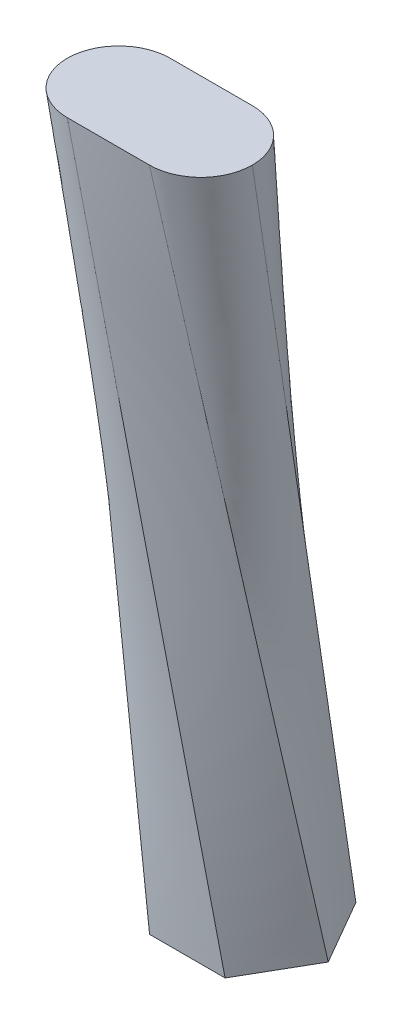
ISO-10303-21;
HEADER;
FILE_DESCRIPTION(('STEP AP214'),'2;1');
FILE_NAME('part.step','',(''),(''),'','','');
FILE_SCHEMA(('AUTOMOTIVE_DESIGN { 1 0 10303 214 1 1 1 1 }'));
ENDSEC;
DATA;
#1=APPLICATION_CONTEXT('core data for automotive mechanical design processes');
#2=APPLICATION_PROTOCOL_DEFINITION('international standard','automotive_design',2000,#1);
#3=PRODUCT_CONTEXT('',#1,'mechanical');
#4=PRODUCT('Part','Part','',(#3));
#5=PRODUCT_RELATED_PRODUCT_CATEGORY('part','',(#4));
#6=PRODUCT_DEFINITION_FORMATION('','',#4);
#7=PRODUCT_DEFINITION_CONTEXT('part definition',#1,'design');
#8=PRODUCT_DEFINITION('design','',#6,#7);
#9=PRODUCT_DEFINITION_SHAPE('','',#8);
#10=(LENGTH_UNIT() NAMED_UNIT(*) SI_UNIT(.MILLI.,.METRE.));
#11=(NAMED_UNIT(*) PLANE_ANGLE_UNIT() SI_UNIT($,.RADIAN.));
#12=(NAMED_UNIT(*) SI_UNIT($,.STERADIAN.) SOLID_ANGLE_UNIT());
#13=UNCERTAINTY_MEASURE_WITH_UNIT(LENGTH_MEASURE(1.E-05),#10,'distance_accuracy_value','');
#14=(GEOMETRIC_REPRESENTATION_CONTEXT(3) GLOBAL_UNCERTAINTY_ASSIGNED_CONTEXT((#13)) GLOBAL_UNIT_ASSIGNED_CONTEXT((#10,
#11,#12)) REPRESENTATION_CONTEXT('',''));
#15=CARTESIAN_POINT('',(0.,0.,0.));
#16=DIRECTION('',(0.,0.,1.));
#17=DIRECTION('',(1.,0.,0.));
#18=AXIS2_PLACEMENT_3D('',#15,#16,#17);
#19=CARTESIAN_POINT('',(0.,-698.8189008,0.));
#20=DIRECTION('',(0.,1.,0.));
#21=DIRECTION('',(0.,0.,1.));
#22=AXIS2_PLACEMENT_3D('',#19,#20,#21);
#23=PLANE('',#22);
#24=DIRECTION('',(1.,0.,0.));
#25=VECTOR('',#24,1.);
#26=CARTESIAN_POINT('',(-35.4084634377862,-698.8189008,84.0918648163071));
#27=LINE('',#26,#25);
#28=CARTESIAN_POINT('',(-35.4084634377862,-698.8189008,84.0918648163071));
#29=VERTEX_POINT('',#28);
#30=CARTESIAN_POINT('',(35.4084634377862,-698.8189008,84.0918648163071));
#31=VERTEX_POINT('',#30);
#32=EDGE_CURVE('E124',#29,#31,#27,.T.);
#33=ORIENTED_EDGE('',*,*,#32,.F.);
#34=DIRECTION('',(0.5,0.,0.866025403784439));
#35=VECTOR('',#34,1.);
#36=CARTESIAN_POINT('',(-70.8169268755724,-698.8189008,22.7626071241164));
#37=LINE('',#36,#35);
#38=CARTESIAN_POINT('',(-70.8169268755724,-698.8189008,22.7626071241164));
#39=VERTEX_POINT('',#38);
#40=EDGE_CURVE('E114',#39,#29,#37,.T.);
#41=ORIENTED_EDGE('',*,*,#40,.F.);
#42=DIRECTION('',(-0.5,0.,0.866025403784439));
#43=VECTOR('',#42,1.);
#44=CARTESIAN_POINT('',(-35.4084634377863,-698.8189008,-38.5666505680744));
#45=LINE('',#44,#43);
#46=CARTESIAN_POINT('',(-35.4084634377863,-698.8189008,-38.5666505680744));
#47=VERTEX_POINT('',#46);
#48=EDGE_CURVE('E138',#47,#39,#45,.T.);
#49=ORIENTED_EDGE('',*,*,#48,.F.);
#50=DIRECTION('',(-1.,0.,0.));
#51=VECTOR('',#50,1.);
#52=CARTESIAN_POINT('',(35.4084634377862,-698.8189008,-38.5666505680744));
#53=LINE('',#52,#51);
#54=CARTESIAN_POINT('',(35.4084634377862,-698.8189008,-38.5666505680744));
#55=VERTEX_POINT('',#54);
#56=EDGE_CURVE('E160',#55,#47,#53,.T.);
#57=ORIENTED_EDGE('',*,*,#56,.F.);
#58=DIRECTION('',(-0.5,0.,-0.866025403784438));
#59=VECTOR('',#58,1.);
#60=CARTESIAN_POINT('',(70.8169268755724,-698.8189008,22.7626071241163));
#61=LINE('',#60,#59);
#62=CARTESIAN_POINT('',(70.8169268755724,-698.8189008,22.7626071241163));
#63=VERTEX_POINT('',#62);
#64=EDGE_CURVE('E149',#63,#55,#61,.T.);
#65=ORIENTED_EDGE('',*,*,#64,.F.);
#66=DIRECTION('',(0.5,0.,-0.866025403784439));
#67=VECTOR('',#66,1.);
#68=CARTESIAN_POINT('',(35.4084634377862,-698.8189008,84.0918648163071));
#69=LINE('',#68,#67);
#70=EDGE_CURVE('E143',#31,#63,#69,.T.);
#71=ORIENTED_EDGE('',*,*,#70,.F.);
#72=EDGE_LOOP('',(#33,#41,#49,#57,#65,#71));
#73=FACE_BOUND('',#72,.T.);
#74=ADVANCED_FACE('F67',(#73),#23,.F.);
#75=CARTESIAN_POINT('',(-38.5065648534128,0.,109.89447289182));
#76=DIRECTION('',(0.,1.,0.));
#77=DIRECTION('',(0.,0.,1.));
#78=AXIS2_PLACEMENT_3D('',#75,#76,#77);
#79=PLANE('',#78);
#80=CARTESIAN_POINT('',(-38.5065648534128,0.,109.89447289182));
#81=DIRECTION('',(0.,1.,0.));
#82=DIRECTION('',(0.,0.,1.));
#83=AXIS2_PLACEMENT_3D('',#80,#81,#82);
#84=CIRCLE('',#83,48.2563794323738);
#85=CARTESIAN_POINT('',(-38.5065648534128,0.,61.6380934594463));
#86=VERTEX_POINT('',#85);
#87=CARTESIAN_POINT('',(-86.7629442857865,0.,109.89447289182));
#88=VERTEX_POINT('',#87);
#89=EDGE_CURVE('E86',#86,#88,#84,.T.);
#90=ORIENTED_EDGE('',*,*,#89,.T.);
#91=CARTESIAN_POINT('',(-38.5065648534128,0.,158.150852324194));
#92=VERTEX_POINT('',#91);
#93=EDGE_CURVE('E127',#88,#92,#84,.T.);
#94=ORIENTED_EDGE('',*,*,#93,.T.);
#95=DIRECTION('',(1.,0.,0.));
#96=VECTOR('',#95,1.);
#97=CARTESIAN_POINT('',(-38.5065648534128,0.,158.150852324194));
#98=LINE('',#97,#96);
#99=CARTESIAN_POINT('',(38.5065648534128,0.,158.150852324194));
#100=VERTEX_POINT('',#99);
#101=EDGE_CURVE('E236',#92,#100,#98,.T.);
#102=ORIENTED_EDGE('',*,*,#101,.T.);
#103=CARTESIAN_POINT('',(38.5065648534128,0.,109.89447289182));
#104=DIRECTION('',(0.,1.,0.));
#105=DIRECTION('',(0.,0.,1.));
#106=AXIS2_PLACEMENT_3D('',#103,#104,#105);
#107=CIRCLE('',#106,48.2563794323738);
#108=CARTESIAN_POINT('',(86.7629442857865,0.,109.89447289182));
#109=VERTEX_POINT('',#108);
#110=EDGE_CURVE('E78',#100,#109,#107,.T.);
#111=ORIENTED_EDGE('',*,*,#110,.T.);
#112=CARTESIAN_POINT('',(38.5065648534128,0.,61.6380934594463));
#113=VERTEX_POINT('',#112);
#114=EDGE_CURVE('E246',#109,#113,#107,.T.);
#115=ORIENTED_EDGE('',*,*,#114,.T.);
#116=DIRECTION('',(-1.,0.,0.));
#117=VECTOR('',#116,1.);
#118=CARTESIAN_POINT('',(-38.5065648534128,0.,61.6380934594463));
#119=LINE('',#118,#117);
#120=EDGE_CURVE('E12',#113,#86,#119,.T.);
#121=ORIENTED_EDGE('',*,*,#120,.T.);
#122=EDGE_LOOP('',(#90,#94,#102,#111,#115,#121));
#123=FACE_BOUND('',#122,.T.);
#124=ADVANCED_FACE('F190',(#123),#79,.T.);
#125=CARTESIAN_POINT('',(-38.5065648534128,0.,158.150852324194));
#126=CARTESIAN_POINT('',(35.4084634377862,-698.8189008,84.0918648163071));
#127=CARTESIAN_POINT('',(-41.3500992810913,0.,158.150852324194));
#128=CARTESIAN_POINT('',(32.457758151304,-698.8189008,84.0918648163071));
#129=CARTESIAN_POINT('',(-44.29997184118,0.,157.898068650708));
#130=CARTESIAN_POINT('',(29.5070528648218,-698.8189008,84.0918648163071));
#131=CARTESIAN_POINT('',(-50.2749140653923,0.,156.792391045333));
#132=CARTESIAN_POINT('',(23.6056422918574,-698.8189008,84.0918648163071));
#133=CARTESIAN_POINT('',(-53.2993762527336,0.,155.938528046976));
#134=CARTESIAN_POINT('',(20.6549370053753,-698.8189008,84.0918648163071));
#135=CARTESIAN_POINT('',(-59.2395893974263,0.,153.586851832366));
#136=CARTESIAN_POINT('',(14.7535264324109,-698.8189008,84.0918648163071));
#137=CARTESIAN_POINT('',(-62.1541363089074,0.,152.08848374934));
#138=CARTESIAN_POINT('',(11.8028211459287,-698.8189008,84.0918648163071));
#139=CARTESIAN_POINT('',(-67.6717163748163,0.,148.481207979422));
#140=CARTESIAN_POINT('',(5.90141057296433,-698.8189008,84.0918648163071));
#141=CARTESIAN_POINT('',(-70.2733169355167,0.,146.372547074001));
#142=CARTESIAN_POINT('',(2.95070528648217,-698.8189008,84.0918648163071));
#143=CARTESIAN_POINT('',(-74.9846390355939,0.,141.661224973924));
#144=CARTESIAN_POINT('',(-2.95070528648221,-698.8189008,84.0918648163071));
#145=CARTESIAN_POINT('',(-77.0932999410149,0.,139.059624413224));
#146=CARTESIAN_POINT('',(-5.90141057296441,-698.8189008,84.0918648163071));
#147=CARTESIAN_POINT('',(-80.7005757109324,0.,133.542044347315));
#148=CARTESIAN_POINT('',(-11.8028211459288,-698.8189008,84.0918648163071));
#149=CARTESIAN_POINT('',(-82.1989437939585,0.,130.627497435834));
#150=CARTESIAN_POINT('',(-14.753526432411,-698.8189008,84.0918648163071));
#151=CARTESIAN_POINT('',(-84.5506200085686,0.,124.687284291141));
#152=CARTESIAN_POINT('',(-20.6549370053754,-698.8189008,84.0918648163071));
#153=CARTESIAN_POINT('',(-85.4044830069252,0.,121.6628221038));
#154=CARTESIAN_POINT('',(-23.6056422918575,-698.8189008,84.0918648163071));
#155=CARTESIAN_POINT('',(-86.5101606123009,0.,115.687879879587));
#156=CARTESIAN_POINT('',(-29.5070528648219,-698.8189008,84.0918648163071));
#157=CARTESIAN_POINT('',(-86.7629442857866,0.,112.738007319499));
#158=CARTESIAN_POINT('',(-32.4577581513041,-698.8189008,84.0918648163071));
#159=CARTESIAN_POINT('',(-86.7629442857865,0.,109.89447289182));
#160=CARTESIAN_POINT('',(-35.4084634377862,-698.8189008,84.0918648163071));
#161=B_SPLINE_SURFACE_WITH_KNOTS('',3,1,((#125,#126),(#127,#128),(#129,#130),(#131,#132),(#133,
#134),(#135,#136),(#137,#138),(#139,#140),(#141,#142),(#143,#144),(#145,#146),(#147,#148),(#149,
#150),(#151,#152),(#153,#154),(#155,#156),(#157,#158),(#159,#160)),.UNSPECIFIED.,.F.,.F.,.F.,(4,
2,2,2,2,2,2,2,4),(2,2),(0.,0.125,0.250000000000001,0.375000000000001,0.500000000000001,
0.625000000000001,0.750000000000001,0.875,1.),(0.,1.),.UNSPECIFIED.);
#162=DIRECTION('',(0.073240266860718,-0.996635190089719,-0.0367989291284342));
#163=VECTOR('',#162,1.);
#164=CARTESIAN_POINT('',(-61.0857038617864,-349.4094504,96.9931688540636));
#165=LINE('',#164,#163);
#166=EDGE_CURVE('E121',#88,#29,#165,.T.);
#167=DIRECTION('',(-0.10460530133073,0.988975630311673,0.104809033881324));
#168=VECTOR('',#167,1.);
#169=CARTESIAN_POINT('',(-1.54905070781327,-349.4094504,121.12135857025));
#170=LINE('',#169,#168);
#171=EDGE_CURVE('E130',#31,#92,#170,.T.);
#172=ORIENTED_EDGE('',*,*,#93,.F.);
#173=ORIENTED_EDGE('',*,*,#166,.T.);
#174=ORIENTED_EDGE('',*,*,#32,.T.);
#175=ORIENTED_EDGE('',*,*,#171,.T.);
#176=EDGE_LOOP('',(#172,#173,#174,#175));
#177=FACE_BOUND('',#176,.T.);
#178=ADVANCED_FACE('F122',(#177),#161,.T.);
#179=CARTESIAN_POINT('',(-86.7629442857865,0.,109.89447289182));
#180=CARTESIAN_POINT('',(-35.4084634377862,-698.8189008,84.0918648163071));
#181=CARTESIAN_POINT('',(-86.7629442857866,0.,107.050938464142));
#182=CARTESIAN_POINT('',(-36.8838160810273,-698.8189008,81.5364790791324));
#183=CARTESIAN_POINT('',(-86.5101606123009,0.,104.101065904053));
#184=CARTESIAN_POINT('',(-38.3591687242684,-698.8189008,78.9810933419578));
#185=CARTESIAN_POINT('',(-85.4044830069252,0.,98.1261236798406));
#186=CARTESIAN_POINT('',(-41.3098740107506,-698.8189008,73.8703218676086));
#187=CARTESIAN_POINT('',(-84.5506200085686,0.,95.1016614924993));
#188=CARTESIAN_POINT('',(-42.7852266539917,-698.8189008,71.314936130434));
#189=CARTESIAN_POINT('',(-82.1989437939585,0.,89.1614483478066));
#190=CARTESIAN_POINT('',(-45.7359319404739,-698.8189008,66.2041646560848));
#191=CARTESIAN_POINT('',(-80.7005757109324,0.,86.2469014363254));
#192=CARTESIAN_POINT('',(-47.211284583715,-698.8189008,63.6487789189102));
#193=CARTESIAN_POINT('',(-77.0932999410149,0.,80.7293213704166));
#194=CARTESIAN_POINT('',(-50.1619898701972,-698.8189008,58.5380074445609));
#195=CARTESIAN_POINT('',(-74.9846390355939,0.,78.1277208097161));
#196=CARTESIAN_POINT('',(-51.6373425134382,-698.8189008,55.9826217073863));
#197=CARTESIAN_POINT('',(-70.2733169355168,0.,73.4163987096391));
#198=CARTESIAN_POINT('',(-54.5880477999204,-698.8189008,50.8718502330371));
#199=CARTESIAN_POINT('',(-67.6717163748163,0.,71.307737804218));
#200=CARTESIAN_POINT('',(-56.0634004431615,-698.8189008,48.3164644958625));
#201=CARTESIAN_POINT('',(-62.1541363089074,0.,67.7004620343004));
#202=CARTESIAN_POINT('',(-59.0141057296437,-698.8189008,43.2056930215133));
#203=CARTESIAN_POINT('',(-59.2395893974263,0.,66.2020939512744));
#204=CARTESIAN_POINT('',(-60.4894583728848,-698.8189008,40.6503072843387));
#205=CARTESIAN_POINT('',(-53.2993762527336,0.,63.8504177366643));
#206=CARTESIAN_POINT('',(-63.440163659367,-698.8189008,35.5395358099894));
#207=CARTESIAN_POINT('',(-50.2749140653923,0.,62.9965547383077));
#208=CARTESIAN_POINT('',(-64.9155163026081,-698.8189008,32.9841500728148));
#209=CARTESIAN_POINT('',(-44.29997184118,0.,61.890877132932));
#210=CARTESIAN_POINT('',(-67.8662215890903,-698.8189008,27.8733785984656));
#211=CARTESIAN_POINT('',(-41.3500992810913,0.,61.6380934594463));
#212=CARTESIAN_POINT('',(-69.3415742323314,-698.8189008,25.317992861291));
#213=CARTESIAN_POINT('',(-38.5065648534128,0.,61.6380934594463));
#214=CARTESIAN_POINT('',(-70.8169268755724,-698.8189008,22.7626071241164));
#215=B_SPLINE_SURFACE_WITH_KNOTS('',3,1,((#179,#180),(#181,#182),(#183,#184),(#185,#186),(#187,
#188),(#189,#190),(#191,#192),(#193,#194),(#195,#196),(#197,#198),(#199,#200),(#201,#202),(#203,
#204),(#205,#206),(#207,#208),(#209,#210),(#211,#212),(#213,#214)),.UNSPECIFIED.,.F.,.F.,.F.,(4,
2,2,2,2,2,2,2,4),(2,2),(0.,0.125,0.25,0.375,0.5,0.625,0.75,0.875,1.),(0.,1.),.UNSPECIFIED.);
#216=DIRECTION('',(-0.0461151821470692,-0.997393990079861,-0.0554853001083709));
#217=VECTOR('',#216,1.);
#218=CARTESIAN_POINT('',(-54.6617458644926,-349.4094504,42.2003502917813));
#219=LINE('',#218,#217);
#220=EDGE_CURVE('E136',#86,#39,#219,.T.);
#221=ORIENTED_EDGE('',*,*,#89,.F.);
#222=ORIENTED_EDGE('',*,*,#220,.T.);
#223=ORIENTED_EDGE('',*,*,#40,.T.);
#224=ORIENTED_EDGE('',*,*,#166,.F.);
#225=EDGE_LOOP('',(#221,#222,#223,#224));
#226=FACE_BOUND('',#225,.T.);
#227=ADVANCED_FACE('F134',(#226),#215,.T.);
#228=CARTESIAN_POINT('',(38.5065648534128,0.,158.150852324194));
#229=CARTESIAN_POINT('',(70.8169268755724,-698.8189008,22.7626071241163));
#230=CARTESIAN_POINT('',(25.6710432356085,0.,158.150852324194));
#231=CARTESIAN_POINT('',(64.9155163026081,-698.8189008,32.9841500728148));
#232=CARTESIAN_POINT('',(12.8355216178042,0.,158.150852324194));
#233=CARTESIAN_POINT('',(59.0141057296437,-698.8189008,43.2056930215132));
#234=CARTESIAN_POINT('',(-12.8355216178043,0.,158.150852324194));
#235=CARTESIAN_POINT('',(47.211284583715,-698.8189008,63.6487789189101));
#236=CARTESIAN_POINT('',(-25.6710432356085,0.,158.150852324194));
#237=CARTESIAN_POINT('',(41.3098740107506,-698.8189008,73.8703218676086));
#238=CARTESIAN_POINT('',(-38.5065648534128,0.,158.150852324194));
#239=CARTESIAN_POINT('',(35.4084634377862,-698.8189008,84.0918648163071));
#240=B_SPLINE_SURFACE_WITH_KNOTS('',3,1,((#228,#229),(#230,#231),(#232,#233),(#234,#235),(#236,
#237),(#238,#239)),.UNSPECIFIED.,.F.,.F.,.F.,(4,2,4),(2,2),(0.,0.5,1.),(0.,1.),.UNSPECIFIED.);
#241=DIRECTION('',(0.045344949416057,-0.980735148867343,-0.190006324470018));
#242=VECTOR('',#241,1.);
#243=CARTESIAN_POINT('',(54.6617458644926,-349.4094504,90.4567297241551));
#244=LINE('',#243,#242);
#245=EDGE_CURVE('E137',#100,#63,#244,.T.);
#246=ORIENTED_EDGE('',*,*,#101,.F.);
#247=ORIENTED_EDGE('',*,*,#171,.F.);
#248=ORIENTED_EDGE('',*,*,#70,.T.);
#249=ORIENTED_EDGE('',*,*,#245,.F.);
#250=EDGE_LOOP('',(#246,#247,#248,#249));
#251=FACE_BOUND('',#250,.T.);
#252=ADVANCED_FACE('F286',(#251),#240,.T.);
#253=CARTESIAN_POINT('',(-38.5065648534128,0.,61.6380934594463));
#254=CARTESIAN_POINT('',(-70.8169268755724,-698.8189008,22.7626071241164));
#255=CARTESIAN_POINT('',(-25.6710432356085,0.,61.6380934594463));
#256=CARTESIAN_POINT('',(-64.915516302608,-698.8189008,12.5410641754178));
#257=CARTESIAN_POINT('',(-12.8355216178042,0.,61.6380934594463));
#258=CARTESIAN_POINT('',(-59.0141057296436,-698.8189008,2.3195212267193));
#259=CARTESIAN_POINT('',(12.8355216178043,0.,61.6380934594463));
#260=CARTESIAN_POINT('',(-47.2112845837149,-698.8189008,-18.1235646706776));
#261=CARTESIAN_POINT('',(25.6710432356085,0.,61.6380934594463));
#262=CARTESIAN_POINT('',(-41.3098740107506,-698.8189008,-28.345107619376));
#263=CARTESIAN_POINT('',(38.5065648534128,0.,61.6380934594463));
#264=CARTESIAN_POINT('',(-35.4084634377863,-698.8189008,-38.5666505680744));
#265=B_SPLINE_SURFACE_WITH_KNOTS('',3,1,((#253,#254),(#255,#256),(#257,#258),(#259,#260),(#261,
#262),(#263,#264)),.UNSPECIFIED.,.F.,.F.,.F.,(4,2,4),(2,2),(0.,0.5,1.),(0.,1.),.UNSPECIFIED.);
#266=DIRECTION('',(-0.104131262569069,-0.98449389968099,-0.141168132546579));
#267=VECTOR('',#266,1.);
#268=CARTESIAN_POINT('',(1.54905070781326,-349.4094504,11.535721445686));
#269=LINE('',#268,#267);
#270=EDGE_CURVE('E264',#113,#47,#269,.T.);
#271=ORIENTED_EDGE('',*,*,#120,.F.);
#272=ORIENTED_EDGE('',*,*,#270,.T.);
#273=ORIENTED_EDGE('',*,*,#48,.T.);
#274=ORIENTED_EDGE('',*,*,#220,.F.);
#275=EDGE_LOOP('',(#271,#272,#273,#274));
#276=FACE_BOUND('',#275,.T.);
#277=ADVANCED_FACE('F297',(#276),#265,.T.);
#278=CARTESIAN_POINT('',(38.5065648534128,0.,61.6380934594463));
#279=CARTESIAN_POINT('',(-35.4084634377862,-698.8189008,-38.5666505680744));
#280=CARTESIAN_POINT('',(41.3500992810913,0.,61.6380934594463));
#281=CARTESIAN_POINT('',(-32.457758151304,-698.8189008,-38.5666505680744));
#282=CARTESIAN_POINT('',(44.29997184118,0.,61.890877132932));
#283=CARTESIAN_POINT('',(-29.5070528648219,-698.8189008,-38.5666505680744));
#284=CARTESIAN_POINT('',(50.2749140653923,0.,62.9965547383076));
#285=CARTESIAN_POINT('',(-23.6056422918575,-698.8189008,-38.5666505680744));
#286=CARTESIAN_POINT('',(53.2993762527336,0.,63.8504177366643));
#287=CARTESIAN_POINT('',(-20.6549370053753,-698.8189008,-38.5666505680744));
#288=CARTESIAN_POINT('',(59.2395893974263,0.,66.2020939512743));
#289=CARTESIAN_POINT('',(-14.7535264324109,-698.8189008,-38.5666505680744));
#290=CARTESIAN_POINT('',(62.1541363089074,0.,67.7004620343004));
#291=CARTESIAN_POINT('',(-11.8028211459287,-698.8189008,-38.5666505680744));
#292=CARTESIAN_POINT('',(67.6717163748163,0.,71.307737804218));
#293=CARTESIAN_POINT('',(-5.90141057296433,-698.8189008,-38.5666505680744));
#294=CARTESIAN_POINT('',(70.2733169355168,0.,73.4163987096391));
#295=CARTESIAN_POINT('',(-2.95070528648215,-698.8189008,-38.5666505680744));
#296=CARTESIAN_POINT('',(74.9846390355939,0.,78.1277208097161));
#297=CARTESIAN_POINT('',(2.95070528648221,-698.8189008,-38.5666505680744));
#298=CARTESIAN_POINT('',(77.0932999410149,0.,80.7293213704166));
#299=CARTESIAN_POINT('',(5.9014105729644,-698.8189008,-38.5666505680744));
#300=CARTESIAN_POINT('',(80.7005757109324,0.,86.2469014363254));
#301=CARTESIAN_POINT('',(11.8028211459288,-698.8189008,-38.5666505680744));
#302=CARTESIAN_POINT('',(82.1989437939585,0.,89.1614483478067));
#303=CARTESIAN_POINT('',(14.7535264324109,-698.8189008,-38.5666505680744));
#304=CARTESIAN_POINT('',(84.5506200085687,0.,95.1016614924993));
#305=CARTESIAN_POINT('',(20.6549370053753,-698.8189008,-38.5666505680744));
#306=CARTESIAN_POINT('',(85.4044830069252,0.,98.1261236798407));
#307=CARTESIAN_POINT('',(23.6056422918575,-698.8189008,-38.5666505680744));
#308=CARTESIAN_POINT('',(86.5101606123009,0.,104.101065904053));
#309=CARTESIAN_POINT('',(29.5070528648218,-698.8189008,-38.5666505680744));
#310=CARTESIAN_POINT('',(86.7629442857865,0.,107.050938464142));
#311=CARTESIAN_POINT('',(32.457758151304,-698.8189008,-38.5666505680744));
#312=CARTESIAN_POINT('',(86.7629442857865,0.,109.89447289182));
#313=CARTESIAN_POINT('',(35.4084634377862,-698.8189008,-38.5666505680744));
#314=B_SPLINE_SURFACE_WITH_KNOTS('',3,1,((#278,#279),(#280,#281),(#282,#283),(#284,#285),(#286,
#287),(#288,#289),(#290,#291),(#292,#293),(#294,#295),(#296,#297),(#298,#299),(#300,#301),(#302,
#303),(#304,#305),(#306,#307),(#308,#309),(#310,#311),(#312,#313)),.UNSPECIFIED.,.F.,.F.,.F.,(4,
2,2,2,2,2,2,2,4),(2,2),(0.,0.125,0.25,0.375,0.5,0.625,0.75,0.875,1.),(0.,1.),.UNSPECIFIED.);
#315=DIRECTION('',(-0.0716982773805905,-0.975652183821244,-0.207273185013146));
#316=VECTOR('',#315,1.);
#317=CARTESIAN_POINT('',(61.0857038617864,-349.4094504,35.6639111618729));
#318=LINE('',#317,#316);
#319=EDGE_CURVE('E262',#109,#55,#318,.T.);
#320=ORIENTED_EDGE('',*,*,#114,.F.);
#321=ORIENTED_EDGE('',*,*,#319,.T.);
#322=ORIENTED_EDGE('',*,*,#56,.T.);
#323=ORIENTED_EDGE('',*,*,#270,.F.);
#324=EDGE_LOOP('',(#320,#321,#322,#323));
#325=FACE_BOUND('',#324,.T.);
#326=ADVANCED_FACE('F261',(#325),#314,.T.);
#327=CARTESIAN_POINT('',(86.7629442857865,0.,109.89447289182));
#328=CARTESIAN_POINT('',(35.4084634377862,-698.8189008,-38.5666505680744));
#329=CARTESIAN_POINT('',(86.7629442857865,0.,112.738007319499));
#330=CARTESIAN_POINT('',(36.8838160810273,-698.8189008,-36.0112648308998));
#331=CARTESIAN_POINT('',(86.5101606123009,0.,115.687879879587));
#332=CARTESIAN_POINT('',(38.3591687242684,-698.8189008,-33.4558790937251));
#333=CARTESIAN_POINT('',(85.4044830069252,0.,121.6628221038));
#334=CARTESIAN_POINT('',(41.3098740107506,-698.8189008,-28.3451076193759));
#335=CARTESIAN_POINT('',(84.5506200085686,0.,124.687284291141));
#336=CARTESIAN_POINT('',(42.7852266539917,-698.8189008,-25.7897218822013));
#337=CARTESIAN_POINT('',(82.1989437939585,0.,130.627497435834));
#338=CARTESIAN_POINT('',(45.7359319404739,-698.8189008,-20.6789504078521));
#339=CARTESIAN_POINT('',(80.7005757109324,0.,133.542044347315));
#340=CARTESIAN_POINT('',(47.211284583715,-698.8189008,-18.1235646706774));
#341=CARTESIAN_POINT('',(77.0932999410149,0.,139.059624413224));
#342=CARTESIAN_POINT('',(50.1619898701972,-698.8189008,-13.0127931963282));
#343=CARTESIAN_POINT('',(74.9846390355939,0.,141.661224973924));
#344=CARTESIAN_POINT('',(51.6373425134383,-698.8189008,-10.4574074591536));
#345=CARTESIAN_POINT('',(70.2733169355167,0.,146.372547074001));
#346=CARTESIAN_POINT('',(54.5880477999204,-698.8189008,-5.34663598480439));
#347=CARTESIAN_POINT('',(67.6717163748163,0.,148.481207979422));
#348=CARTESIAN_POINT('',(56.0634004431615,-698.8189008,-2.79125024762977));
#349=CARTESIAN_POINT('',(62.1541363089074,0.,152.08848374934));
#350=CARTESIAN_POINT('',(59.0141057296437,-698.8189008,2.31952122671945));
#351=CARTESIAN_POINT('',(59.2395893974262,0.,153.586851832366));
#352=CARTESIAN_POINT('',(60.4894583728848,-698.8189008,4.87490696389406));
#353=CARTESIAN_POINT('',(53.2993762527336,0.,155.938528046976));
#354=CARTESIAN_POINT('',(63.440163659367,-698.8189008,9.98567843824327));
#355=CARTESIAN_POINT('',(50.2749140653923,0.,156.792391045333));
#356=CARTESIAN_POINT('',(64.9155163026081,-698.8189008,12.5410641754179));
#357=CARTESIAN_POINT('',(44.29997184118,0.,157.898068650708));
#358=CARTESIAN_POINT('',(67.8662215890903,-698.8189008,17.6518356497671));
#359=CARTESIAN_POINT('',(41.3500992810913,0.,158.150852324194));
#360=CARTESIAN_POINT('',(69.3415742323314,-698.8189008,20.2072213869417));
#361=CARTESIAN_POINT('',(38.5065648534128,0.,158.150852324194));
#362=CARTESIAN_POINT('',(70.8169268755724,-698.8189008,22.7626071241163));
#363=B_SPLINE_SURFACE_WITH_KNOTS('',3,1,((#327,#328),(#329,#330),(#331,#332),(#333,#334),(#335,
#336),(#337,#338),(#339,#340),(#341,#342),(#343,#344),(#345,#346),(#347,#348),(#349,#350),(#351,
#352),(#353,#354),(#355,#356),(#357,#358),(#359,#360),(#361,#362)),.UNSPECIFIED.,.F.,.F.,.F.,(4,
2,2,2,2,2,2,2,4),(2,2),(0.,0.125,0.25,0.375,0.5,0.625,0.75,0.875,1.),(0.,1.),.UNSPECIFIED.);
#364=ORIENTED_EDGE('',*,*,#110,.F.);
#365=ORIENTED_EDGE('',*,*,#245,.T.);
#366=ORIENTED_EDGE('',*,*,#64,.T.);
#367=ORIENTED_EDGE('',*,*,#319,.F.);
#368=EDGE_LOOP('',(#364,#365,#366,#367));
#369=FACE_BOUND('',#368,.T.);
#370=ADVANCED_FACE('F268',(#369),#363,.T.);
#371=CLOSED_SHELL('',(#74,#124,#178,#227,#252,#277,#326,#370));
#372=MANIFOLD_SOLID_BREP('B2',#371);
#373=ADVANCED_BREP_SHAPE_REPRESENTATION('',(#18,#372),#14);
#374=SHAPE_DEFINITION_REPRESENTATION(#9,#373);
ENDSEC;
END-ISO-10303-21;
